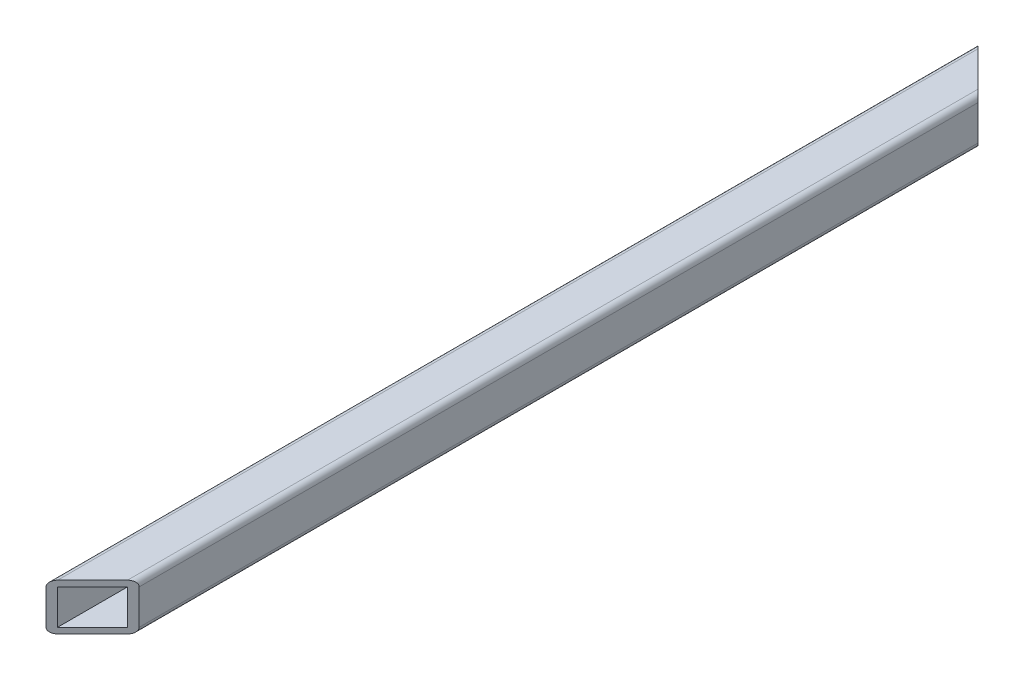
ISO-10303-21;
HEADER;
FILE_DESCRIPTION(('STEP AP214'),'2;1');
FILE_NAME('part.step','',(''),(''),'','','');
FILE_SCHEMA(('AUTOMOTIVE_DESIGN { 1 0 10303 214 1 1 1 1 }'));
ENDSEC;
DATA;
#1=APPLICATION_CONTEXT('core data for automotive mechanical design processes');
#2=APPLICATION_PROTOCOL_DEFINITION('international standard','automotive_design',2000,#1);
#3=PRODUCT_CONTEXT('',#1,'mechanical');
#4=PRODUCT('Part','Part','',(#3));
#5=PRODUCT_RELATED_PRODUCT_CATEGORY('part','',(#4));
#6=PRODUCT_DEFINITION_FORMATION('','',#4);
#7=PRODUCT_DEFINITION_CONTEXT('part definition',#1,'design');
#8=PRODUCT_DEFINITION('design','',#6,#7);
#9=PRODUCT_DEFINITION_SHAPE('','',#8);
#10=(LENGTH_UNIT() NAMED_UNIT(*) SI_UNIT(.MILLI.,.METRE.));
#11=(NAMED_UNIT(*) PLANE_ANGLE_UNIT() SI_UNIT($,.RADIAN.));
#12=(NAMED_UNIT(*) SI_UNIT($,.STERADIAN.) SOLID_ANGLE_UNIT());
#13=UNCERTAINTY_MEASURE_WITH_UNIT(LENGTH_MEASURE(1.E-05),#10,'distance_accuracy_value','');
#14=(GEOMETRIC_REPRESENTATION_CONTEXT(3) GLOBAL_UNCERTAINTY_ASSIGNED_CONTEXT((#13)) GLOBAL_UNIT_ASSIGNED_CONTEXT((#10,
#11,#12)) REPRESENTATION_CONTEXT('',''));
#15=CARTESIAN_POINT('',(0.,0.,0.));
#16=DIRECTION('',(0.,0.,1.));
#17=DIRECTION('',(1.,0.,0.));
#18=AXIS2_PLACEMENT_3D('',#15,#16,#17);
#19=CARTESIAN_POINT('',(11.1125,1.5875,254.));
#20=DIRECTION('',(0.,1.,0.));
#21=DIRECTION('',(-1.,0.,0.));
#22=AXIS2_PLACEMENT_3D('',#19,#20,#21);
#23=PLANE('',#22);
#24=DIRECTION('',(-0.707106781186548,0.,0.707106781186547));
#25=VECTOR('',#24,1.);
#26=CARTESIAN_POINT('',(5.55625,1.5875,248.44375));
#27=LINE('',#26,#25);
#28=CARTESIAN_POINT('',(11.1125,1.5875,242.8875));
#29=VERTEX_POINT('',#28);
#30=CARTESIAN_POINT('',(1.5875,1.5875,252.4125));
#31=VERTEX_POINT('',#30);
#32=EDGE_CURVE('E141',#29,#31,#27,.T.);
#33=ORIENTED_EDGE('',*,*,#32,.F.);
#34=DIRECTION('',(0.,0.,-1.));
#35=VECTOR('',#34,1.);
#36=CARTESIAN_POINT('',(11.1125,1.5875,254.));
#37=LINE('',#36,#35);
#38=CARTESIAN_POINT('',(11.1125,1.5875,11.1125000000001));
#39=VERTEX_POINT('',#38);
#40=EDGE_CURVE('E149',#29,#39,#37,.T.);
#41=ORIENTED_EDGE('',*,*,#40,.T.);
#42=DIRECTION('',(0.707106781186548,0.,0.707106781186548));
#43=VECTOR('',#42,1.);
#44=CARTESIAN_POINT('',(132.55625,1.58750000000001,132.55625));
#45=LINE('',#44,#43);
#46=CARTESIAN_POINT('',(1.58750000000001,1.5875,1.5875000000001));
#47=VERTEX_POINT('',#46);
#48=EDGE_CURVE('E128',#47,#39,#45,.T.);
#49=ORIENTED_EDGE('',*,*,#48,.F.);
#50=DIRECTION('',(0.,0.,-1.));
#51=VECTOR('',#50,1.);
#52=CARTESIAN_POINT('',(1.5875,1.5875,254.));
#53=LINE('',#52,#51);
#54=EDGE_CURVE('E158',#31,#47,#53,.T.);
#55=ORIENTED_EDGE('',*,*,#54,.F.);
#56=EDGE_LOOP('',(#33,#41,#49,#55));
#57=FACE_BOUND('',#56,.T.);
#58=ADVANCED_FACE('F38',(#57),#23,.T.);
#59=CARTESIAN_POINT('',(1.5875,11.1125,254.));
#60=DIRECTION('',(1.,0.,0.));
#61=DIRECTION('',(0.,1.,0.));
#62=AXIS2_PLACEMENT_3D('',#59,#60,#61);
#63=PLANE('',#62);
#64=CARTESIAN_POINT('',(1.5875,6.34999999999998,136.525));
#65=DIRECTION('',(1.,0.,0.));
#66=DIRECTION('',(0.,1.,0.));
#67=AXIS2_PLACEMENT_3D('',#64,#65,#66);
#68=CIRCLE('',#67,2.03200000000001);
#69=CARTESIAN_POINT('',(1.5875,8.38199999999999,136.525));
#70=VERTEX_POINT('',#69);
#71=EDGE_CURVE('E249',#70,#70,#68,.F.);
#72=ORIENTED_EDGE('',*,*,#71,.T.);
#73=EDGE_LOOP('',(#72));
#74=FACE_BOUND('',#73,.T.);
#75=CARTESIAN_POINT('',(1.5875,6.34999999999998,117.475));
#76=DIRECTION('',(1.,0.,0.));
#77=DIRECTION('',(0.,1.,0.));
#78=AXIS2_PLACEMENT_3D('',#75,#76,#77);
#79=CIRCLE('',#78,2.03200000000001);
#80=CARTESIAN_POINT('',(1.5875,8.38199999999999,117.475));
#81=VERTEX_POINT('',#80);
#82=EDGE_CURVE('E335',#81,#81,#79,.F.);
#83=ORIENTED_EDGE('',*,*,#82,.T.);
#84=EDGE_LOOP('',(#83));
#85=FACE_BOUND('',#84,.T.);
#86=DIRECTION('',(0.,1.,0.));
#87=VECTOR('',#86,1.);
#88=CARTESIAN_POINT('',(1.5875,11.1125,252.4125));
#89=LINE('',#88,#87);
#90=CARTESIAN_POINT('',(1.5875,11.1125,252.4125));
#91=VERTEX_POINT('',#90);
#92=EDGE_CURVE('E153',#31,#91,#89,.T.);
#93=ORIENTED_EDGE('',*,*,#92,.F.);
#94=ORIENTED_EDGE('',*,*,#54,.T.);
#95=DIRECTION('',(0.,-1.,0.));
#96=VECTOR('',#95,1.);
#97=CARTESIAN_POINT('',(1.5875,11.1125,1.58750000000002));
#98=LINE('',#97,#96);
#99=CARTESIAN_POINT('',(1.5875,11.1125,1.58750000000002));
#100=VERTEX_POINT('',#99);
#101=EDGE_CURVE('E135',#100,#47,#98,.T.);
#102=ORIENTED_EDGE('',*,*,#101,.F.);
#103=DIRECTION('',(0.,0.,-1.));
#104=VECTOR('',#103,1.);
#105=CARTESIAN_POINT('',(1.5875,11.1125,254.));
#106=LINE('',#105,#104);
#107=EDGE_CURVE('E163',#91,#100,#106,.T.);
#108=ORIENTED_EDGE('',*,*,#107,.F.);
#109=EDGE_LOOP('',(#93,#94,#102,#108));
#110=FACE_BOUND('',#109,.T.);
#111=ADVANCED_FACE('F270',(#74,#85,#110),#63,.T.);
#112=CARTESIAN_POINT('',(11.1125,11.1125,254.));
#113=DIRECTION('',(0.,-1.,0.));
#114=DIRECTION('',(1.,0.,0.));
#115=AXIS2_PLACEMENT_3D('',#112,#113,#114);
#116=PLANE('',#115);
#117=DIRECTION('',(0.707106781186548,0.,-0.707106781186547));
#118=VECTOR('',#117,1.);
#119=CARTESIAN_POINT('',(5.55625,11.1125,248.44375));
#120=LINE('',#119,#118);
#121=CARTESIAN_POINT('',(11.1125,11.1125,242.8875));
#122=VERTEX_POINT('',#121);
#123=EDGE_CURVE('E165',#91,#122,#120,.T.);
#124=ORIENTED_EDGE('',*,*,#123,.F.);
#125=ORIENTED_EDGE('',*,*,#107,.T.);
#126=DIRECTION('',(-0.707106781186548,0.,-0.707106781186548));
#127=VECTOR('',#126,1.);
#128=CARTESIAN_POINT('',(132.55625,11.1125,132.55625));
#129=LINE('',#128,#127);
#130=CARTESIAN_POINT('',(11.1125,11.1125,11.1125000000001));
#131=VERTEX_POINT('',#130);
#132=EDGE_CURVE('E154',#131,#100,#129,.T.);
#133=ORIENTED_EDGE('',*,*,#132,.F.);
#134=DIRECTION('',(0.,0.,-1.));
#135=VECTOR('',#134,1.);
#136=CARTESIAN_POINT('',(11.1125,11.1125,254.));
#137=LINE('',#136,#135);
#138=EDGE_CURVE('E151',#122,#131,#137,.T.);
#139=ORIENTED_EDGE('',*,*,#138,.F.);
#140=EDGE_LOOP('',(#124,#125,#133,#139));
#141=FACE_BOUND('',#140,.T.);
#142=ADVANCED_FACE('F268',(#141),#116,.T.);
#143=CARTESIAN_POINT('',(11.1125,11.1125,254.));
#144=DIRECTION('',(-1.,0.,0.));
#145=DIRECTION('',(0.,-1.,0.));
#146=AXIS2_PLACEMENT_3D('',#143,#144,#145);
#147=PLANE('',#146);
#148=DIRECTION('',(0.,-1.,0.));
#149=VECTOR('',#148,1.);
#150=CARTESIAN_POINT('',(11.1125,11.1125,242.8875));
#151=LINE('',#150,#149);
#152=EDGE_CURVE('E159',#122,#29,#151,.T.);
#153=ORIENTED_EDGE('',*,*,#152,.F.);
#154=ORIENTED_EDGE('',*,*,#138,.T.);
#155=DIRECTION('',(0.,1.,0.));
#156=VECTOR('',#155,1.);
#157=CARTESIAN_POINT('',(11.1125,11.1125,11.1125));
#158=LINE('',#157,#156);
#159=EDGE_CURVE('E132',#39,#131,#158,.T.);
#160=ORIENTED_EDGE('',*,*,#159,.F.);
#161=ORIENTED_EDGE('',*,*,#40,.F.);
#162=EDGE_LOOP('',(#153,#154,#160,#161));
#163=FACE_BOUND('',#162,.T.);
#164=ADVANCED_FACE('F148',(#163),#147,.T.);
#165=CARTESIAN_POINT('',(0.,0.,0.));
#166=DIRECTION('',(-0.707106781186548,0.,0.707106781186548));
#167=DIRECTION('',(0.707106781186548,0.,0.707106781186548));
#168=AXIS2_PLACEMENT_3D('',#165,#166,#167);
#169=PLANE('',#168);
#170=ORIENTED_EDGE('',*,*,#159,.T.);
#171=ORIENTED_EDGE('',*,*,#132,.T.);
#172=ORIENTED_EDGE('',*,*,#101,.T.);
#173=ORIENTED_EDGE('',*,*,#48,.T.);
#174=EDGE_LOOP('',(#170,#171,#172,#173));
#175=FACE_BOUND('',#174,.T.);
#176=DIRECTION('',(0.,1.,0.));
#177=VECTOR('',#176,1.);
#178=CARTESIAN_POINT('',(12.7,0.,12.7));
#179=LINE('',#178,#177);
#180=CARTESIAN_POINT('',(12.7,1.5875,12.7));
#181=VERTEX_POINT('',#180);
#182=CARTESIAN_POINT('',(12.7,11.1125,12.7));
#183=VERTEX_POINT('',#182);
#184=EDGE_CURVE('E246',#181,#183,#179,.T.);
#185=ORIENTED_EDGE('',*,*,#184,.F.);
#186=CARTESIAN_POINT('',(11.1125,1.5875,11.1125));
#187=DIRECTION('',(-0.707106781186548,0.,0.707106781186548));
#188=DIRECTION('',(-0.707106781186548,0.,-0.707106781186548));
#189=AXIS2_PLACEMENT_3D('',#186,#187,#188);
#190=ELLIPSE('',#189,2.24506403026729,1.5875);
#191=CARTESIAN_POINT('',(11.1125,0.,11.1125));
#192=VERTEX_POINT('',#191);
#193=EDGE_CURVE('E197',#181,#192,#190,.F.);
#194=ORIENTED_EDGE('',*,*,#193,.T.);
#195=DIRECTION('',(0.707106781186548,0.,0.707106781186548));
#196=VECTOR('',#195,1.);
#197=CARTESIAN_POINT('',(0.,0.,0.));
#198=LINE('',#197,#196);
#199=CARTESIAN_POINT('',(1.5875,0.,1.5875));
#200=VERTEX_POINT('',#199);
#201=EDGE_CURVE('E240',#200,#192,#198,.T.);
#202=ORIENTED_EDGE('',*,*,#201,.F.);
#203=CARTESIAN_POINT('',(1.5875,1.5875,1.58750000000002));
#204=DIRECTION('',(-0.707106781186548,0.,0.707106781186548));
#205=DIRECTION('',(-0.707106781186548,0.,-0.707106781186548));
#206=AXIS2_PLACEMENT_3D('',#203,#204,#205);
#207=ELLIPSE('',#206,2.24506403026729,1.5875);
#208=CARTESIAN_POINT('',(0.,1.5875,0.));
#209=VERTEX_POINT('',#208);
#210=EDGE_CURVE('E194',#200,#209,#207,.F.);
#211=ORIENTED_EDGE('',*,*,#210,.T.);
#212=DIRECTION('',(0.,-1.,0.));
#213=VECTOR('',#212,1.);
#214=CARTESIAN_POINT('',(0.,0.,0.));
#215=LINE('',#214,#213);
#216=CARTESIAN_POINT('',(0.,11.1125,0.));
#217=VERTEX_POINT('',#216);
#218=EDGE_CURVE('E174',#217,#209,#215,.T.);
#219=ORIENTED_EDGE('',*,*,#218,.F.);
#220=CARTESIAN_POINT('',(1.5875,11.1125,1.58750000000002));
#221=DIRECTION('',(-0.707106781186548,0.,0.707106781186548));
#222=DIRECTION('',(-0.707106781186548,0.,-0.707106781186548));
#223=AXIS2_PLACEMENT_3D('',#220,#221,#222);
#224=ELLIPSE('',#223,2.24506403026729,1.5875);
#225=CARTESIAN_POINT('',(1.5875,12.7,1.5875));
#226=VERTEX_POINT('',#225);
#227=EDGE_CURVE('E191',#217,#226,#224,.F.);
#228=ORIENTED_EDGE('',*,*,#227,.T.);
#229=DIRECTION('',(0.707106781186548,0.,0.707106781186548));
#230=VECTOR('',#229,1.);
#231=CARTESIAN_POINT('',(0.,12.7,0.));
#232=LINE('',#231,#230);
#233=CARTESIAN_POINT('',(11.1125,12.7,11.1125));
#234=VERTEX_POINT('',#233);
#235=EDGE_CURVE('E231',#226,#234,#232,.T.);
#236=ORIENTED_EDGE('',*,*,#235,.T.);
#237=CARTESIAN_POINT('',(11.1125,11.1125,11.1125));
#238=DIRECTION('',(-0.707106781186548,0.,0.707106781186548));
#239=DIRECTION('',(-0.707106781186548,0.,-0.707106781186548));
#240=AXIS2_PLACEMENT_3D('',#237,#238,#239);
#241=ELLIPSE('',#240,2.24506403026729,1.5875);
#242=EDGE_CURVE('E188',#234,#183,#241,.F.);
#243=ORIENTED_EDGE('',*,*,#242,.T.);
#244=EDGE_LOOP('',(#185,#194,#202,#211,#219,#228,#236,#243));
#245=FACE_BOUND('',#244,.T.);
#246=ADVANCED_FACE('F130',(#175,#245),#169,.F.);
#247=CARTESIAN_POINT('',(12.7,0.,241.3));
#248=DIRECTION('',(-0.707106781186547,0.,-0.707106781186548));
#249=DIRECTION('',(-0.707106781186548,0.,0.707106781186547));
#250=AXIS2_PLACEMENT_3D('',#247,#248,#249);
#251=PLANE('',#250);
#252=ORIENTED_EDGE('',*,*,#152,.T.);
#253=ORIENTED_EDGE('',*,*,#32,.T.);
#254=ORIENTED_EDGE('',*,*,#92,.T.);
#255=ORIENTED_EDGE('',*,*,#123,.T.);
#256=EDGE_LOOP('',(#252,#253,#254,#255));
#257=FACE_BOUND('',#256,.T.);
#258=DIRECTION('',(-0.707106781186548,0.,0.707106781186547));
#259=VECTOR('',#258,1.);
#260=CARTESIAN_POINT('',(12.7,0.,241.3));
#261=LINE('',#260,#259);
#262=CARTESIAN_POINT('',(11.1125,0.,242.8875));
#263=VERTEX_POINT('',#262);
#264=CARTESIAN_POINT('',(1.58750000000001,0.,252.4125));
#265=VERTEX_POINT('',#264);
#266=EDGE_CURVE('E322',#263,#265,#261,.T.);
#267=ORIENTED_EDGE('',*,*,#266,.F.);
#268=CARTESIAN_POINT('',(11.1125,1.5875,242.8875));
#269=DIRECTION('',(-0.707106781186547,0.,-0.707106781186548));
#270=DIRECTION('',(0.707106781186548,0.,-0.707106781186547));
#271=AXIS2_PLACEMENT_3D('',#268,#269,#270);
#272=ELLIPSE('',#271,2.24506403026729,1.5875);
#273=CARTESIAN_POINT('',(12.7,1.5875,241.3));
#274=VERTEX_POINT('',#273);
#275=EDGE_CURVE('E215',#263,#274,#272,.F.);
#276=ORIENTED_EDGE('',*,*,#275,.T.);
#277=DIRECTION('',(0.,1.,0.));
#278=VECTOR('',#277,1.);
#279=CARTESIAN_POINT('',(12.7,0.,241.3));
#280=LINE('',#279,#278);
#281=CARTESIAN_POINT('',(12.7,11.1125,241.3));
#282=VERTEX_POINT('',#281);
#283=EDGE_CURVE('E257',#274,#282,#280,.T.);
#284=ORIENTED_EDGE('',*,*,#283,.T.);
#285=CARTESIAN_POINT('',(11.1125,11.1125,242.8875));
#286=DIRECTION('',(-0.707106781186547,0.,-0.707106781186548));
#287=DIRECTION('',(0.707106781186548,0.,-0.707106781186547));
#288=AXIS2_PLACEMENT_3D('',#285,#286,#287);
#289=ELLIPSE('',#288,2.24506403026729,1.5875);
#290=CARTESIAN_POINT('',(11.1125,12.7,242.8875));
#291=VERTEX_POINT('',#290);
#292=EDGE_CURVE('E207',#282,#291,#289,.F.);
#293=ORIENTED_EDGE('',*,*,#292,.T.);
#294=DIRECTION('',(-0.707106781186548,0.,0.707106781186547));
#295=VECTOR('',#294,1.);
#296=CARTESIAN_POINT('',(12.7,12.7,241.3));
#297=LINE('',#296,#295);
#298=CARTESIAN_POINT('',(1.58750000000001,12.7,252.4125));
#299=VERTEX_POINT('',#298);
#300=EDGE_CURVE('E233',#291,#299,#297,.T.);
#301=ORIENTED_EDGE('',*,*,#300,.T.);
#302=CARTESIAN_POINT('',(1.5875,11.1125,252.4125));
#303=DIRECTION('',(-0.707106781186547,0.,-0.707106781186548));
#304=DIRECTION('',(0.707106781186548,0.,-0.707106781186547));
#305=AXIS2_PLACEMENT_3D('',#302,#303,#304);
#306=ELLIPSE('',#305,2.24506403026729,1.5875);
#307=CARTESIAN_POINT('',(0.,11.1125,254.));
#308=VERTEX_POINT('',#307);
#309=EDGE_CURVE('E61',#299,#308,#306,.F.);
#310=ORIENTED_EDGE('',*,*,#309,.T.);
#311=DIRECTION('',(0.,-1.,0.));
#312=VECTOR('',#311,1.);
#313=CARTESIAN_POINT('',(0.,0.,254.));
#314=LINE('',#313,#312);
#315=CARTESIAN_POINT('',(0.,1.5875,254.));
#316=VERTEX_POINT('',#315);
#317=EDGE_CURVE('E142',#308,#316,#314,.T.);
#318=ORIENTED_EDGE('',*,*,#317,.T.);
#319=CARTESIAN_POINT('',(1.5875,1.5875,252.4125));
#320=DIRECTION('',(-0.707106781186547,0.,-0.707106781186548));
#321=DIRECTION('',(0.707106781186548,0.,-0.707106781186547));
#322=AXIS2_PLACEMENT_3D('',#319,#320,#321);
#323=ELLIPSE('',#322,2.24506403026729,1.5875);
#324=EDGE_CURVE('E212',#316,#265,#323,.F.);
#325=ORIENTED_EDGE('',*,*,#324,.T.);
#326=EDGE_LOOP('',(#267,#276,#284,#293,#301,#310,#318,#325));
#327=FACE_BOUND('',#326,.T.);
#328=ADVANCED_FACE('F264',(#257,#327),#251,.F.);
#329=CARTESIAN_POINT('',(0.,0.,254.));
#330=DIRECTION('',(1.,0.,0.));
#331=DIRECTION('',(0.,0.,-1.));
#332=AXIS2_PLACEMENT_3D('',#329,#330,#331);
#333=PLANE('',#332);
#334=CARTESIAN_POINT('',(0.,6.34999999999998,136.525));
#335=DIRECTION('',(-1.,0.,0.));
#336=DIRECTION('',(0.,0.,1.));
#337=AXIS2_PLACEMENT_3D('',#334,#335,#336);
#338=CIRCLE('',#337,2.03200000000001);
#339=CARTESIAN_POINT('',(0.,6.34999999999998,138.557));
#340=VERTEX_POINT('',#339);
#341=EDGE_CURVE('E241',#340,#340,#338,.T.);
#342=ORIENTED_EDGE('',*,*,#341,.F.);
#343=EDGE_LOOP('',(#342));
#344=FACE_BOUND('',#343,.T.);
#345=CARTESIAN_POINT('',(0.,6.34999999999998,117.475));
#346=DIRECTION('',(-1.,0.,0.));
#347=DIRECTION('',(0.,0.,1.));
#348=AXIS2_PLACEMENT_3D('',#345,#346,#347);
#349=CIRCLE('',#348,2.03200000000001);
#350=CARTESIAN_POINT('',(0.,6.34999999999998,119.507));
#351=VERTEX_POINT('',#350);
#352=EDGE_CURVE('E331',#351,#351,#349,.T.);
#353=ORIENTED_EDGE('',*,*,#352,.F.);
#354=EDGE_LOOP('',(#353));
#355=FACE_BOUND('',#354,.T.);
#356=ORIENTED_EDGE('',*,*,#218,.T.);
#357=DIRECTION('',(0.,0.,-1.));
#358=VECTOR('',#357,1.);
#359=CARTESIAN_POINT('',(0.,1.5875,254.));
#360=LINE('',#359,#358);
#361=EDGE_CURVE('E54',#209,#316,#360,.F.);
#362=ORIENTED_EDGE('',*,*,#361,.T.);
#363=ORIENTED_EDGE('',*,*,#317,.F.);
#364=DIRECTION('',(0.,0.,-1.));
#365=VECTOR('',#364,1.);
#366=CARTESIAN_POINT('',(0.,11.1125,254.));
#367=LINE('',#366,#365);
#368=EDGE_CURVE('E218',#308,#217,#367,.T.);
#369=ORIENTED_EDGE('',*,*,#368,.T.);
#370=EDGE_LOOP('',(#356,#362,#363,#369));
#371=FACE_BOUND('',#370,.T.);
#372=ADVANCED_FACE('F298',(#344,#355,#371),#333,.F.);
#373=CARTESIAN_POINT('',(0.,0.,254.));
#374=DIRECTION('',(0.,1.,0.));
#375=DIRECTION('',(0.,0.,1.));
#376=AXIS2_PLACEMENT_3D('',#373,#374,#375);
#377=PLANE('',#376);
#378=ORIENTED_EDGE('',*,*,#201,.T.);
#379=DIRECTION('',(0.,0.,-1.));
#380=VECTOR('',#379,1.);
#381=CARTESIAN_POINT('',(11.1125,0.,254.));
#382=LINE('',#381,#380);
#383=EDGE_CURVE('E204',#192,#263,#382,.F.);
#384=ORIENTED_EDGE('',*,*,#383,.T.);
#385=ORIENTED_EDGE('',*,*,#266,.T.);
#386=DIRECTION('',(0.,0.,-1.));
#387=VECTOR('',#386,1.);
#388=CARTESIAN_POINT('',(1.5875,0.,254.));
#389=LINE('',#388,#387);
#390=EDGE_CURVE('E200',#265,#200,#389,.T.);
#391=ORIENTED_EDGE('',*,*,#390,.T.);
#392=EDGE_LOOP('',(#378,#384,#385,#391));
#393=FACE_BOUND('',#392,.T.);
#394=ADVANCED_FACE('F294',(#393),#377,.F.);
#395=CARTESIAN_POINT('',(12.7,0.,254.));
#396=DIRECTION('',(-1.,0.,0.));
#397=DIRECTION('',(0.,0.,1.));
#398=AXIS2_PLACEMENT_3D('',#395,#396,#397);
#399=PLANE('',#398);
#400=ORIENTED_EDGE('',*,*,#283,.F.);
#401=DIRECTION('',(0.,0.,-1.));
#402=VECTOR('',#401,1.);
#403=CARTESIAN_POINT('',(12.7,1.5875,254.));
#404=LINE('',#403,#402);
#405=EDGE_CURVE('E184',#274,#181,#404,.T.);
#406=ORIENTED_EDGE('',*,*,#405,.T.);
#407=ORIENTED_EDGE('',*,*,#184,.T.);
#408=DIRECTION('',(0.,0.,-1.));
#409=VECTOR('',#408,1.);
#410=CARTESIAN_POINT('',(12.7,11.1125,254.));
#411=LINE('',#410,#409);
#412=EDGE_CURVE('E181',#183,#282,#411,.F.);
#413=ORIENTED_EDGE('',*,*,#412,.T.);
#414=EDGE_LOOP('',(#400,#406,#407,#413));
#415=FACE_BOUND('',#414,.T.);
#416=ADVANCED_FACE('F291',(#415),#399,.F.);
#417=CARTESIAN_POINT('',(0.,12.7,254.));
#418=DIRECTION('',(0.,-1.,0.));
#419=DIRECTION('',(1.,0.,0.));
#420=AXIS2_PLACEMENT_3D('',#417,#418,#419);
#421=PLANE('',#420);
#422=ORIENTED_EDGE('',*,*,#235,.F.);
#423=DIRECTION('',(0.,0.,-1.));
#424=VECTOR('',#423,1.);
#425=CARTESIAN_POINT('',(1.5875,12.7,254.));
#426=LINE('',#425,#424);
#427=EDGE_CURVE('E11',#226,#299,#426,.F.);
#428=ORIENTED_EDGE('',*,*,#427,.T.);
#429=ORIENTED_EDGE('',*,*,#300,.F.);
#430=DIRECTION('',(0.,0.,-1.));
#431=VECTOR('',#430,1.);
#432=CARTESIAN_POINT('',(11.1125,12.7,254.));
#433=LINE('',#432,#431);
#434=EDGE_CURVE('E47',#291,#234,#433,.T.);
#435=ORIENTED_EDGE('',*,*,#434,.T.);
#436=EDGE_LOOP('',(#422,#428,#429,#435));
#437=FACE_BOUND('',#436,.T.);
#438=ADVANCED_FACE('F230',(#437),#421,.F.);
#439=CARTESIAN_POINT('',(11.1125,1.5875,254.));
#440=DIRECTION('',(0.,0.,-1.));
#441=DIRECTION('',(-1.,0.,0.));
#442=AXIS2_PLACEMENT_3D('',#439,#440,#441);
#443=CYLINDRICAL_SURFACE('',#442,1.5875);
#444=ORIENTED_EDGE('',*,*,#275,.F.);
#445=ORIENTED_EDGE('',*,*,#383,.F.);
#446=ORIENTED_EDGE('',*,*,#193,.F.);
#447=ORIENTED_EDGE('',*,*,#405,.F.);
#448=EDGE_LOOP('',(#444,#445,#446,#447));
#449=FACE_BOUND('',#448,.T.);
#450=ADVANCED_FACE('F290',(#449),#443,.T.);
#451=CARTESIAN_POINT('',(1.5875,1.5875,254.));
#452=DIRECTION('',(0.,0.,-1.));
#453=DIRECTION('',(-1.,0.,0.));
#454=AXIS2_PLACEMENT_3D('',#451,#452,#453);
#455=CYLINDRICAL_SURFACE('',#454,1.5875);
#456=ORIENTED_EDGE('',*,*,#324,.F.);
#457=ORIENTED_EDGE('',*,*,#361,.F.);
#458=ORIENTED_EDGE('',*,*,#210,.F.);
#459=ORIENTED_EDGE('',*,*,#390,.F.);
#460=EDGE_LOOP('',(#456,#457,#458,#459));
#461=FACE_BOUND('',#460,.T.);
#462=ADVANCED_FACE('F304',(#461),#455,.T.);
#463=CARTESIAN_POINT('',(1.5875,11.1125,254.));
#464=DIRECTION('',(0.,0.,-1.));
#465=DIRECTION('',(-1.,0.,0.));
#466=AXIS2_PLACEMENT_3D('',#463,#464,#465);
#467=CYLINDRICAL_SURFACE('',#466,1.5875);
#468=ORIENTED_EDGE('',*,*,#309,.F.);
#469=ORIENTED_EDGE('',*,*,#427,.F.);
#470=ORIENTED_EDGE('',*,*,#227,.F.);
#471=ORIENTED_EDGE('',*,*,#368,.F.);
#472=EDGE_LOOP('',(#468,#469,#470,#471));
#473=FACE_BOUND('',#472,.T.);
#474=ADVANCED_FACE('F307',(#473),#467,.T.);
#475=CARTESIAN_POINT('',(11.1125,11.1125,254.));
#476=DIRECTION('',(0.,0.,-1.));
#477=DIRECTION('',(-1.,0.,0.));
#478=AXIS2_PLACEMENT_3D('',#475,#476,#477);
#479=CYLINDRICAL_SURFACE('',#478,1.5875);
#480=ORIENTED_EDGE('',*,*,#292,.F.);
#481=ORIENTED_EDGE('',*,*,#412,.F.);
#482=ORIENTED_EDGE('',*,*,#242,.F.);
#483=ORIENTED_EDGE('',*,*,#434,.F.);
#484=EDGE_LOOP('',(#480,#481,#482,#483));
#485=FACE_BOUND('',#484,.T.);
#486=ADVANCED_FACE('F40',(#485),#479,.T.);
#487=CARTESIAN_POINT('',(12.701,6.34999999999998,117.475));
#488=DIRECTION('',(-1.,0.,0.));
#489=DIRECTION('',(0.,0.,1.));
#490=AXIS2_PLACEMENT_3D('',#487,#488,#489);
#491=CYLINDRICAL_SURFACE('',#490,2.03200000000001);
#492=ORIENTED_EDGE('',*,*,#82,.F.);
#493=EDGE_LOOP('',(#492));
#494=FACE_BOUND('',#493,.T.);
#495=ORIENTED_EDGE('',*,*,#352,.T.);
#496=EDGE_LOOP('',(#495));
#497=FACE_BOUND('',#496,.T.);
#498=ADVANCED_FACE('F314',(#494,#497),#491,.F.);
#499=CARTESIAN_POINT('',(12.701,6.34999999999998,136.525));
#500=DIRECTION('',(-1.,0.,0.));
#501=DIRECTION('',(0.,0.,1.));
#502=AXIS2_PLACEMENT_3D('',#499,#500,#501);
#503=CYLINDRICAL_SURFACE('',#502,2.03200000000001);
#504=ORIENTED_EDGE('',*,*,#71,.F.);
#505=EDGE_LOOP('',(#504));
#506=FACE_BOUND('',#505,.T.);
#507=ORIENTED_EDGE('',*,*,#341,.T.);
#508=EDGE_LOOP('',(#507));
#509=FACE_BOUND('',#508,.T.);
#510=ADVANCED_FACE('F342',(#506,#509),#503,.F.);
#511=CLOSED_SHELL('',(#58,#111,#142,#164,#246,#328,#372,#394,#416,#438,#450,#462,#474,#486,#498,#510));
#512=MANIFOLD_SOLID_BREP('B2',#511);
#513=ADVANCED_BREP_SHAPE_REPRESENTATION('',(#18,#512),#14);
#514=SHAPE_DEFINITION_REPRESENTATION(#9,#513);
ENDSEC;
END-ISO-10303-21;
